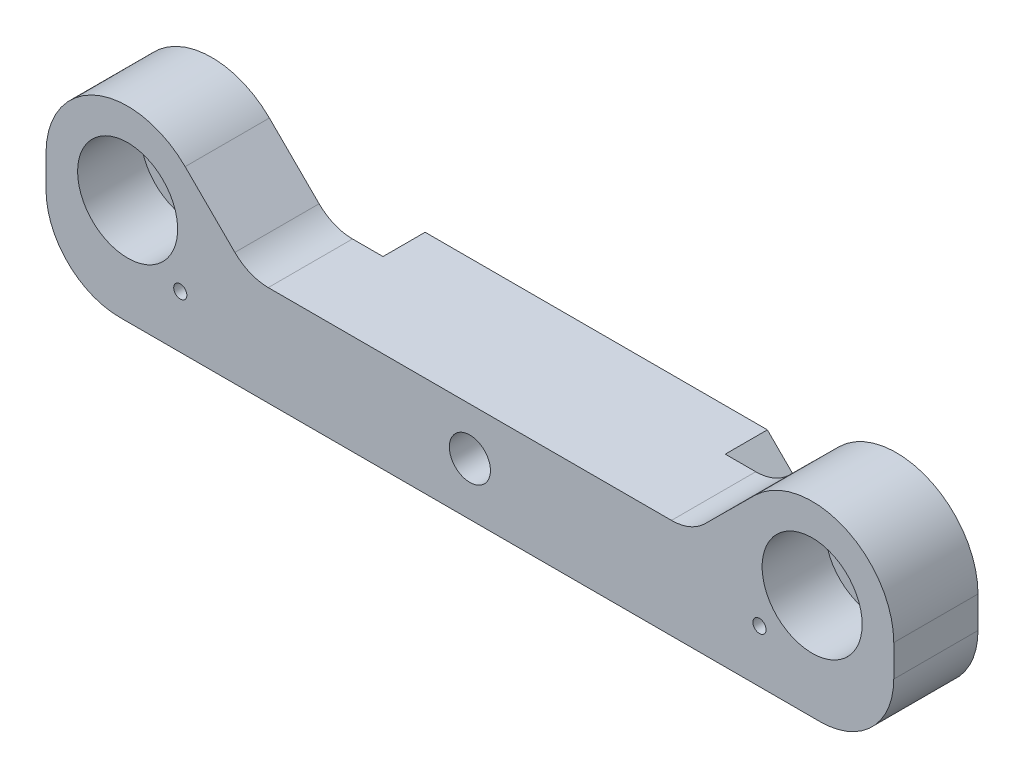
ISO-10303-21;
HEADER;
FILE_DESCRIPTION(('STEP AP214'),'2;1');
FILE_NAME('part.step','',(''),(''),'','','');
FILE_SCHEMA(('AUTOMOTIVE_DESIGN { 1 0 10303 214 1 1 1 1 }'));
ENDSEC;
DATA;
#1=APPLICATION_CONTEXT('core data for automotive mechanical design processes');
#2=APPLICATION_PROTOCOL_DEFINITION('international standard','automotive_design',2000,#1);
#3=PRODUCT_CONTEXT('',#1,'mechanical');
#4=PRODUCT('Part','Part','',(#3));
#5=PRODUCT_RELATED_PRODUCT_CATEGORY('part','',(#4));
#6=PRODUCT_DEFINITION_FORMATION('','',#4);
#7=PRODUCT_DEFINITION_CONTEXT('part definition',#1,'design');
#8=PRODUCT_DEFINITION('design','',#6,#7);
#9=PRODUCT_DEFINITION_SHAPE('','',#8);
#10=(LENGTH_UNIT() NAMED_UNIT(*) SI_UNIT(.MILLI.,.METRE.));
#11=(NAMED_UNIT(*) PLANE_ANGLE_UNIT() SI_UNIT($,.RADIAN.));
#12=(NAMED_UNIT(*) SI_UNIT($,.STERADIAN.) SOLID_ANGLE_UNIT());
#13=UNCERTAINTY_MEASURE_WITH_UNIT(LENGTH_MEASURE(1.E-05),#10,'distance_accuracy_value','');
#14=(GEOMETRIC_REPRESENTATION_CONTEXT(3) GLOBAL_UNCERTAINTY_ASSIGNED_CONTEXT((#13)) GLOBAL_UNIT_ASSIGNED_CONTEXT((#10,
#11,#12)) REPRESENTATION_CONTEXT('',''));
#15=CARTESIAN_POINT('',(0.,0.,0.));
#16=DIRECTION('',(0.,0.,1.));
#17=DIRECTION('',(1.,0.,0.));
#18=AXIS2_PLACEMENT_3D('',#15,#16,#17);
#19=CARTESIAN_POINT('',(-16.25,4.5,12.));
#20=DIRECTION('',(-0.707106781186544,0.707106781186551,0.));
#21=DIRECTION('',(-0.707106781186551,-0.707106781186544,0.));
#22=AXIS2_PLACEMENT_3D('',#19,#20,#21);
#23=PLANE('',#22);
#24=DIRECTION('',(-0.707106781186551,-0.707106781186544,0.));
#25=VECTOR('',#24,1.);
#26=CARTESIAN_POINT('',(-16.25,4.5,4.));
#27=LINE('',#26,#25);
#28=CARTESIAN_POINT('',(-16.25,4.5,4.));
#29=VERTEX_POINT('',#28);
#30=CARTESIAN_POINT('',(-18.75,1.99999999999998,4.));
#31=VERTEX_POINT('',#30);
#32=EDGE_CURVE('E372',#29,#31,#27,.T.);
#33=ORIENTED_EDGE('',*,*,#32,.F.);
#34=DIRECTION('',(0.,0.,1.));
#35=VECTOR('',#34,1.);
#36=CARTESIAN_POINT('',(-16.25,4.5,12.));
#37=LINE('',#36,#35);
#38=CARTESIAN_POINT('',(-16.25,4.5,0.));
#39=VERTEX_POINT('',#38);
#40=EDGE_CURVE('E367',#39,#29,#37,.T.);
#41=ORIENTED_EDGE('',*,*,#40,.F.);
#42=DIRECTION('',(0.707106781186551,0.707106781186544,0.));
#43=VECTOR('',#42,1.);
#44=CARTESIAN_POINT('',(2.87500000000018,23.6249999999999,0.));
#45=LINE('',#44,#43);
#46=CARTESIAN_POINT('',(-18.75,1.99999999999997,0.));
#47=VERTEX_POINT('',#46);
#48=EDGE_CURVE('E252',#47,#39,#45,.T.);
#49=ORIENTED_EDGE('',*,*,#48,.F.);
#50=DIRECTION('',(0.,0.,-1.));
#51=VECTOR('',#50,1.);
#52=CARTESIAN_POINT('',(-18.75,1.99999999999998,0.));
#53=LINE('',#52,#51);
#54=EDGE_CURVE('E379',#31,#47,#53,.T.);
#55=ORIENTED_EDGE('',*,*,#54,.F.);
#56=EDGE_LOOP('',(#33,#41,#49,#55));
#57=FACE_BOUND('',#56,.T.);
#58=ADVANCED_FACE('F39',(#57),#23,.T.);
#59=CARTESIAN_POINT('',(16.25,4.5,12.));
#60=DIRECTION('',(0.707106781186544,0.707106781186551,0.));
#61=DIRECTION('',(-0.707106781186551,0.707106781186544,0.));
#62=AXIS2_PLACEMENT_3D('',#59,#60,#61);
#63=PLANE('',#62);
#64=DIRECTION('',(0.,0.,-1.));
#65=VECTOR('',#64,1.);
#66=CARTESIAN_POINT('',(16.25,4.5,0.));
#67=LINE('',#66,#65);
#68=CARTESIAN_POINT('',(16.25,4.5,4.));
#69=VERTEX_POINT('',#68);
#70=CARTESIAN_POINT('',(16.25,4.5,0.));
#71=VERTEX_POINT('',#70);
#72=EDGE_CURVE('E282',#69,#71,#67,.T.);
#73=ORIENTED_EDGE('',*,*,#72,.F.);
#74=DIRECTION('',(-0.707106781186551,0.707106781186544,0.));
#75=VECTOR('',#74,1.);
#76=CARTESIAN_POINT('',(16.25,4.5,4.));
#77=LINE('',#76,#75);
#78=CARTESIAN_POINT('',(18.75,1.99999999999998,4.));
#79=VERTEX_POINT('',#78);
#80=EDGE_CURVE('E286',#79,#69,#77,.T.);
#81=ORIENTED_EDGE('',*,*,#80,.F.);
#82=DIRECTION('',(0.,0.,1.));
#83=VECTOR('',#82,1.);
#84=CARTESIAN_POINT('',(18.75,1.99999999999998,12.));
#85=LINE('',#84,#83);
#86=CARTESIAN_POINT('',(18.75,1.99999999999998,0.));
#87=VERTEX_POINT('',#86);
#88=EDGE_CURVE('E374',#87,#79,#85,.T.);
#89=ORIENTED_EDGE('',*,*,#88,.F.);
#90=DIRECTION('',(0.707106781186551,-0.707106781186544,0.));
#91=VECTOR('',#90,1.);
#92=CARTESIAN_POINT('',(12.125,8.62499999999995,0.));
#93=LINE('',#92,#91);
#94=EDGE_CURVE('E248',#71,#87,#93,.T.);
#95=ORIENTED_EDGE('',*,*,#94,.F.);
#96=EDGE_LOOP('',(#73,#81,#89,#95));
#97=FACE_BOUND('',#96,.T.);
#98=ADVANCED_FACE('F530',(#97),#63,.T.);
#99=CARTESIAN_POINT('',(15.,0.,12.));
#100=DIRECTION('',(0.,0.,1.));
#101=DIRECTION('',(1.,0.,0.));
#102=AXIS2_PLACEMENT_3D('',#99,#100,#101);
#103=CYLINDRICAL_SURFACE('',#102,0.999999999999997);
#104=CARTESIAN_POINT('',(15.,0.,0.));
#105=DIRECTION('',(0.,0.,-1.));
#106=DIRECTION('',(-1.,0.,0.));
#107=AXIS2_PLACEMENT_3D('',#104,#105,#106);
#108=CIRCLE('',#107,0.999999999999997);
#109=CARTESIAN_POINT('',(14.,0.,0.));
#110=VERTEX_POINT('',#109);
#111=EDGE_CURVE('E316',#110,#110,#108,.T.);
#112=ORIENTED_EDGE('',*,*,#111,.T.);
#113=EDGE_LOOP('',(#112));
#114=FACE_BOUND('',#113,.T.);
#115=CARTESIAN_POINT('',(15.,0.,10.));
#116=DIRECTION('',(0.,0.,1.));
#117=DIRECTION('',(1.,0.,0.));
#118=AXIS2_PLACEMENT_3D('',#115,#116,#117);
#119=CIRCLE('',#118,0.999999999999997);
#120=CARTESIAN_POINT('',(16.,0.,10.));
#121=VERTEX_POINT('',#120);
#122=EDGE_CURVE('E393',#121,#121,#119,.F.);
#123=ORIENTED_EDGE('',*,*,#122,.F.);
#124=EDGE_LOOP('',(#123));
#125=FACE_BOUND('',#124,.T.);
#126=ADVANCED_FACE('F535',(#114,#125),#103,.F.);
#127=CARTESIAN_POINT('',(-15.,0.,12.));
#128=DIRECTION('',(0.,0.,1.));
#129=DIRECTION('',(1.,0.,0.));
#130=AXIS2_PLACEMENT_3D('',#127,#128,#129);
#131=CYLINDRICAL_SURFACE('',#130,0.999999999999991);
#132=CARTESIAN_POINT('',(-15.,0.,0.));
#133=DIRECTION('',(0.,0.,-1.));
#134=DIRECTION('',(-1.,0.,0.));
#135=AXIS2_PLACEMENT_3D('',#132,#133,#134);
#136=CIRCLE('',#135,0.999999999999991);
#137=CARTESIAN_POINT('',(-16.,0.,0.));
#138=VERTEX_POINT('',#137);
#139=EDGE_CURVE('E320',#138,#138,#136,.T.);
#140=ORIENTED_EDGE('',*,*,#139,.T.);
#141=EDGE_LOOP('',(#140));
#142=FACE_BOUND('',#141,.T.);
#143=CARTESIAN_POINT('',(-15.,0.,10.));
#144=DIRECTION('',(0.,0.,1.));
#145=DIRECTION('',(1.,0.,0.));
#146=AXIS2_PLACEMENT_3D('',#143,#144,#145);
#147=CIRCLE('',#146,0.999999999999991);
#148=CARTESIAN_POINT('',(-14.,0.,10.));
#149=VERTEX_POINT('',#148);
#150=EDGE_CURVE('E391',#149,#149,#147,.F.);
#151=ORIENTED_EDGE('',*,*,#150,.F.);
#152=EDGE_LOOP('',(#151));
#153=FACE_BOUND('',#152,.T.);
#154=ADVANCED_FACE('F592',(#142,#153),#131,.F.);
#155=CARTESIAN_POINT('',(0.,0.,12.));
#156=DIRECTION('',(0.,0.,1.));
#157=DIRECTION('',(1.,0.,0.));
#158=AXIS2_PLACEMENT_3D('',#155,#156,#157);
#159=CYLINDRICAL_SURFACE('',#158,1.45);
#160=CARTESIAN_POINT('',(0.,0.,0.));
#161=DIRECTION('',(0.,0.,-1.));
#162=DIRECTION('',(-1.,0.,0.));
#163=AXIS2_PLACEMENT_3D('',#160,#161,#162);
#164=CIRCLE('',#163,1.45);
#165=CARTESIAN_POINT('',(-1.45,0.,0.));
#166=VERTEX_POINT('',#165);
#167=EDGE_CURVE('E236',#166,#166,#164,.T.);
#168=ORIENTED_EDGE('',*,*,#167,.T.);
#169=EDGE_LOOP('',(#168));
#170=FACE_BOUND('',#169,.T.);
#171=CARTESIAN_POINT('',(0.,0.,7.5));
#172=DIRECTION('',(0.,0.,1.));
#173=DIRECTION('',(1.,0.,0.));
#174=AXIS2_PLACEMENT_3D('',#171,#172,#173);
#175=CIRCLE('',#174,1.45);
#176=CARTESIAN_POINT('',(1.45,0.,7.5));
#177=VERTEX_POINT('',#176);
#178=EDGE_CURVE('E226',#177,#177,#175,.F.);
#179=ORIENTED_EDGE('',*,*,#178,.F.);
#180=EDGE_LOOP('',(#179));
#181=FACE_BOUND('',#180,.T.);
#182=ADVANCED_FACE('F589',(#170,#181),#159,.F.);
#183=CARTESIAN_POINT('',(-32.5,5.,22.));
#184=DIRECTION('',(0.,0.,-1.));
#185=DIRECTION('',(-1.,0.,0.));
#186=AXIS2_PLACEMENT_3D('',#183,#184,#185);
#187=CYLINDRICAL_SURFACE('',#186,3.1);
#188=CARTESIAN_POINT('',(-32.5,5.,6.));
#189=DIRECTION('',(0.,0.,1.));
#190=DIRECTION('',(1.,0.,0.));
#191=AXIS2_PLACEMENT_3D('',#188,#189,#190);
#192=CIRCLE('',#191,3.1);
#193=CARTESIAN_POINT('',(-29.4,5.,6.));
#194=VERTEX_POINT('',#193);
#195=EDGE_CURVE('E339',#194,#194,#192,.T.);
#196=ORIENTED_EDGE('',*,*,#195,.T.);
#197=EDGE_LOOP('',(#196));
#198=FACE_BOUND('',#197,.T.);
#199=CARTESIAN_POINT('',(-32.5,5.,4.));
#200=DIRECTION('',(0.,0.,-1.));
#201=DIRECTION('',(-1.,0.,0.));
#202=AXIS2_PLACEMENT_3D('',#199,#200,#201);
#203=CIRCLE('',#202,3.1);
#204=CARTESIAN_POINT('',(-35.6,5.,4.));
#205=VERTEX_POINT('',#204);
#206=EDGE_CURVE('E267',#205,#205,#203,.T.);
#207=ORIENTED_EDGE('',*,*,#206,.T.);
#208=EDGE_LOOP('',(#207));
#209=FACE_BOUND('',#208,.T.);
#210=ADVANCED_FACE('F525',(#198,#209),#187,.F.);
#211=CARTESIAN_POINT('',(32.5,5.,22.));
#212=DIRECTION('',(0.,0.,-1.));
#213=DIRECTION('',(-1.,0.,0.));
#214=AXIS2_PLACEMENT_3D('',#211,#212,#213);
#215=CYLINDRICAL_SURFACE('',#214,3.1);
#216=CARTESIAN_POINT('',(32.5,5.,6.));
#217=DIRECTION('',(0.,0.,1.));
#218=DIRECTION('',(1.,0.,0.));
#219=AXIS2_PLACEMENT_3D('',#216,#217,#218);
#220=CIRCLE('',#219,3.1);
#221=CARTESIAN_POINT('',(35.6,5.,6.));
#222=VERTEX_POINT('',#221);
#223=EDGE_CURVE('E321',#222,#222,#220,.T.);
#224=ORIENTED_EDGE('',*,*,#223,.T.);
#225=EDGE_LOOP('',(#224));
#226=FACE_BOUND('',#225,.T.);
#227=CARTESIAN_POINT('',(32.5,5.,4.));
#228=DIRECTION('',(0.,0.,-1.));
#229=DIRECTION('',(-1.,0.,0.));
#230=AXIS2_PLACEMENT_3D('',#227,#228,#229);
#231=CIRCLE('',#230,3.1);
#232=CARTESIAN_POINT('',(29.4,5.,4.));
#233=VERTEX_POINT('',#232);
#234=EDGE_CURVE('E299',#233,#233,#231,.T.);
#235=ORIENTED_EDGE('',*,*,#234,.T.);
#236=EDGE_LOOP('',(#235));
#237=FACE_BOUND('',#236,.T.);
#238=ADVANCED_FACE('F517',(#226,#237),#215,.F.);
#239=CARTESIAN_POINT('',(-39.25,3.49999999999999,12.));
#240=DIRECTION('',(0.,0.,1.));
#241=DIRECTION('',(1.,0.,0.));
#242=AXIS2_PLACEMENT_3D('',#239,#240,#241);
#243=PLANE('',#242);
#244=DIRECTION('',(0.,1.,0.));
#245=VECTOR('',#244,1.);
#246=CARTESIAN_POINT('',(-40.25,-5.,12.));
#247=LINE('',#246,#245);
#248=CARTESIAN_POINT('',(-40.25,2.,12.));
#249=VERTEX_POINT('',#248);
#250=CARTESIAN_POINT('',(-40.25,5.,12.));
#251=VERTEX_POINT('',#250);
#252=EDGE_CURVE('E205',#249,#251,#247,.T.);
#253=ORIENTED_EDGE('',*,*,#252,.F.);
#254=CARTESIAN_POINT('',(-33.25,2.,12.));
#255=DIRECTION('',(0.,0.,1.));
#256=DIRECTION('',(1.,0.,0.));
#257=AXIS2_PLACEMENT_3D('',#254,#255,#256);
#258=CIRCLE('',#257,7.);
#259=CARTESIAN_POINT('',(-33.25,-5.,12.));
#260=VERTEX_POINT('',#259);
#261=EDGE_CURVE('E427',#249,#260,#258,.T.);
#262=ORIENTED_EDGE('',*,*,#261,.T.);
#263=DIRECTION('',(-1.,0.,0.));
#264=VECTOR('',#263,1.);
#265=CARTESIAN_POINT('',(39.25,-5.,12.));
#266=LINE('',#265,#264);
#267=CARTESIAN_POINT('',(33.25,-5.,12.));
#268=VERTEX_POINT('',#267);
#269=EDGE_CURVE('E501',#268,#260,#266,.T.);
#270=ORIENTED_EDGE('',*,*,#269,.F.);
#271=CARTESIAN_POINT('',(33.25,2.,12.));
#272=DIRECTION('',(0.,0.,1.));
#273=DIRECTION('',(1.,0.,0.));
#274=AXIS2_PLACEMENT_3D('',#271,#272,#273);
#275=CIRCLE('',#274,7.);
#276=CARTESIAN_POINT('',(40.25,2.00000000000001,12.));
#277=VERTEX_POINT('',#276);
#278=EDGE_CURVE('E61',#268,#277,#275,.T.);
#279=ORIENTED_EDGE('',*,*,#278,.T.);
#280=DIRECTION('',(0.,-1.,0.));
#281=VECTOR('',#280,1.);
#282=CARTESIAN_POINT('',(40.25,-5.,12.));
#283=LINE('',#282,#281);
#284=CARTESIAN_POINT('',(40.25,5.,12.));
#285=VERTEX_POINT('',#284);
#286=EDGE_CURVE('E189',#285,#277,#283,.T.);
#287=ORIENTED_EDGE('',*,*,#286,.F.);
#288=CARTESIAN_POINT('',(32.5,5.,12.));
#289=DIRECTION('',(0.,0.,1.));
#290=DIRECTION('',(1.,0.,0.));
#291=AXIS2_PLACEMENT_3D('',#288,#289,#290);
#292=CIRCLE('',#291,7.75000000000001);
#293=CARTESIAN_POINT('',(27.0381210469589,10.4982159199441,12.));
#294=VERTEX_POINT('',#293);
#295=EDGE_CURVE('E178',#294,#285,#292,.F.);
#296=ORIENTED_EDGE('',*,*,#295,.F.);
#297=DIRECTION('',(0.709447215476664,0.704758574585941,0.));
#298=VECTOR('',#297,1.);
#299=CARTESIAN_POINT('',(27.038121046959,10.4982159199442,12.));
#300=LINE('',#299,#298);
#301=CARTESIAN_POINT('',(22.316186026152,5.80748753035501,12.));
#302=VERTEX_POINT('',#301);
#303=EDGE_CURVE('E441',#302,#294,#300,.T.);
#304=ORIENTED_EDGE('',*,*,#303,.F.);
#305=CARTESIAN_POINT('',(19.1447724405153,9.,12.));
#306=DIRECTION('',(0.,0.,1.));
#307=DIRECTION('',(1.,0.,0.));
#308=AXIS2_PLACEMENT_3D('',#305,#306,#307);
#309=CIRCLE('',#308,4.5);
#310=CARTESIAN_POINT('',(19.1447724405153,4.5,12.));
#311=VERTEX_POINT('',#310);
#312=EDGE_CURVE('E411',#302,#311,#309,.F.);
#313=ORIENTED_EDGE('',*,*,#312,.T.);
#314=DIRECTION('',(1.,0.,0.));
#315=VECTOR('',#314,1.);
#316=CARTESIAN_POINT('',(-18.75,4.5,12.));
#317=LINE('',#316,#315);
#318=CARTESIAN_POINT('',(-19.1447724405153,4.5,12.));
#319=VERTEX_POINT('',#318);
#320=EDGE_CURVE('E229',#319,#311,#317,.T.);
#321=ORIENTED_EDGE('',*,*,#320,.F.);
#322=CARTESIAN_POINT('',(-19.1447724405153,9.,12.));
#323=DIRECTION('',(0.,0.,1.));
#324=DIRECTION('',(1.,0.,0.));
#325=AXIS2_PLACEMENT_3D('',#322,#323,#324);
#326=CIRCLE('',#325,4.5);
#327=CARTESIAN_POINT('',(-22.316186026152,5.80748753035501,12.));
#328=VERTEX_POINT('',#327);
#329=EDGE_CURVE('E415',#319,#328,#326,.F.);
#330=ORIENTED_EDGE('',*,*,#329,.T.);
#331=DIRECTION('',(0.709447215476664,-0.704758574585941,0.));
#332=VECTOR('',#331,1.);
#333=CARTESIAN_POINT('',(-27.038121046959,10.4982159199442,12.));
#334=LINE('',#333,#332);
#335=CARTESIAN_POINT('',(-27.038121046959,10.4982159199442,12.));
#336=VERTEX_POINT('',#335);
#337=EDGE_CURVE('E447',#336,#328,#334,.T.);
#338=ORIENTED_EDGE('',*,*,#337,.F.);
#339=CARTESIAN_POINT('',(-32.5,5.,12.));
#340=DIRECTION('',(0.,0.,1.));
#341=DIRECTION('',(1.,0.,0.));
#342=AXIS2_PLACEMENT_3D('',#339,#340,#341);
#343=CIRCLE('',#342,7.75000000000001);
#344=EDGE_CURVE('E220',#251,#336,#343,.F.);
#345=ORIENTED_EDGE('',*,*,#344,.F.);
#346=EDGE_LOOP('',(#253,#262,#270,#279,#287,#296,#304,#313,#321,#330,#338,#345));
#347=FACE_BOUND('',#346,.T.);
#348=CARTESIAN_POINT('',(-27.5000005327804,0.00437002060559369,12.));
#349=DIRECTION('',(0.,0.,1.));
#350=DIRECTION('',(1.,0.,0.));
#351=AXIS2_PLACEMENT_3D('',#348,#349,#350);
#352=CIRCLE('',#351,0.624999999999997);
#353=CARTESIAN_POINT('',(-26.8750005327804,0.00437002060559369,12.));
#354=VERTEX_POINT('',#353);
#355=EDGE_CURVE('E484',#354,#354,#352,.T.);
#356=ORIENTED_EDGE('',*,*,#355,.F.);
#357=EDGE_LOOP('',(#356));
#358=FACE_BOUND('',#357,.T.);
#359=CARTESIAN_POINT('',(27.4999979927804,-0.0043700202019166,12.));
#360=DIRECTION('',(0.,0.,1.));
#361=DIRECTION('',(1.,0.,0.));
#362=AXIS2_PLACEMENT_3D('',#359,#360,#361);
#363=CIRCLE('',#362,0.624999999999997);
#364=CARTESIAN_POINT('',(28.1249979927804,-0.0043700202019166,12.));
#365=VERTEX_POINT('',#364);
#366=EDGE_CURVE('E478',#365,#365,#363,.T.);
#367=ORIENTED_EDGE('',*,*,#366,.F.);
#368=EDGE_LOOP('',(#367));
#369=FACE_BOUND('',#368,.T.);
#370=CARTESIAN_POINT('',(0.,0.,12.));
#371=DIRECTION('',(0.,0.,1.));
#372=DIRECTION('',(1.,0.,0.));
#373=AXIS2_PLACEMENT_3D('',#370,#371,#372);
#374=CIRCLE('',#373,1.95);
#375=CARTESIAN_POINT('',(1.95,0.,12.));
#376=VERTEX_POINT('',#375);
#377=EDGE_CURVE('E219',#376,#376,#374,.T.);
#378=ORIENTED_EDGE('',*,*,#377,.F.);
#379=EDGE_LOOP('',(#378));
#380=FACE_BOUND('',#379,.T.);
#381=CARTESIAN_POINT('',(-32.5,5.,12.));
#382=DIRECTION('',(0.,0.,-1.));
#383=DIRECTION('',(-1.,0.,0.));
#384=AXIS2_PLACEMENT_3D('',#381,#382,#383);
#385=CIRCLE('',#384,4.75);
#386=CARTESIAN_POINT('',(-37.25,5.,12.));
#387=VERTEX_POINT('',#386);
#388=EDGE_CURVE('E503',#387,#387,#385,.T.);
#389=ORIENTED_EDGE('',*,*,#388,.T.);
#390=EDGE_LOOP('',(#389));
#391=FACE_BOUND('',#390,.T.);
#392=CARTESIAN_POINT('',(32.5,5.,12.));
#393=DIRECTION('',(0.,0.,1.));
#394=DIRECTION('',(1.,0.,0.));
#395=AXIS2_PLACEMENT_3D('',#392,#393,#394);
#396=CIRCLE('',#395,4.75);
#397=CARTESIAN_POINT('',(37.25,5.,12.));
#398=VERTEX_POINT('',#397);
#399=EDGE_CURVE('E322',#398,#398,#396,.T.);
#400=ORIENTED_EDGE('',*,*,#399,.F.);
#401=EDGE_LOOP('',(#400));
#402=FACE_BOUND('',#401,.T.);
#403=ADVANCED_FACE('F191',(#347,#358,#369,#380,#391,#402),#243,.T.);
#404=CARTESIAN_POINT('',(-18.75,-3.50000000000001,-3.15));
#405=DIRECTION('',(1.,0.,0.));
#406=DIRECTION('',(0.,1.,0.));
#407=AXIS2_PLACEMENT_3D('',#404,#405,#406);
#408=PLANE('',#407);
#409=DIRECTION('',(0.,-1.,0.));
#410=VECTOR('',#409,1.);
#411=CARTESIAN_POINT('',(-18.75,-3.50000000000001,0.));
#412=LINE('',#411,#410);
#413=CARTESIAN_POINT('',(-18.75,-2.49999999999999,0.));
#414=VERTEX_POINT('',#413);
#415=EDGE_CURVE('E327',#47,#414,#412,.T.);
#416=ORIENTED_EDGE('',*,*,#415,.T.);
#417=DIRECTION('',(0.,0.,1.));
#418=VECTOR('',#417,1.);
#419=CARTESIAN_POINT('',(-18.75,-2.49999999999999,4.));
#420=LINE('',#419,#418);
#421=CARTESIAN_POINT('',(-18.75,-2.49999999999999,4.));
#422=VERTEX_POINT('',#421);
#423=EDGE_CURVE('E378',#414,#422,#420,.T.);
#424=ORIENTED_EDGE('',*,*,#423,.T.);
#425=DIRECTION('',(0.,-1.,0.));
#426=VECTOR('',#425,1.);
#427=CARTESIAN_POINT('',(-18.75,-5.,4.));
#428=LINE('',#427,#426);
#429=EDGE_CURVE('E264',#31,#422,#428,.T.);
#430=ORIENTED_EDGE('',*,*,#429,.F.);
#431=ORIENTED_EDGE('',*,*,#54,.T.);
#432=EDGE_LOOP('',(#416,#424,#430,#431));
#433=FACE_BOUND('',#432,.T.);
#434=ADVANCED_FACE('F384',(#433),#408,.F.);
#435=CARTESIAN_POINT('',(18.75,-3.50000000000001,-3.15));
#436=DIRECTION('',(-1.,0.,0.));
#437=DIRECTION('',(0.,-1.,0.));
#438=AXIS2_PLACEMENT_3D('',#435,#436,#437);
#439=PLANE('',#438);
#440=DIRECTION('',(0.,1.,0.));
#441=VECTOR('',#440,1.);
#442=CARTESIAN_POINT('',(18.75,-5.,4.));
#443=LINE('',#442,#441);
#444=CARTESIAN_POINT('',(18.75,-2.49999999999998,4.));
#445=VERTEX_POINT('',#444);
#446=EDGE_CURVE('E295',#445,#79,#443,.T.);
#447=ORIENTED_EDGE('',*,*,#446,.F.);
#448=DIRECTION('',(0.,0.,-1.));
#449=VECTOR('',#448,1.);
#450=CARTESIAN_POINT('',(18.75,-2.49999999999998,0.));
#451=LINE('',#450,#449);
#452=CARTESIAN_POINT('',(18.75,-2.49999999999998,0.));
#453=VERTEX_POINT('',#452);
#454=EDGE_CURVE('E373',#445,#453,#451,.T.);
#455=ORIENTED_EDGE('',*,*,#454,.T.);
#456=DIRECTION('',(0.,-1.,0.));
#457=VECTOR('',#456,1.);
#458=CARTESIAN_POINT('',(18.75,-3.50000000000001,0.));
#459=LINE('',#458,#457);
#460=EDGE_CURVE('E330',#87,#453,#459,.T.);
#461=ORIENTED_EDGE('',*,*,#460,.F.);
#462=ORIENTED_EDGE('',*,*,#88,.T.);
#463=EDGE_LOOP('',(#447,#455,#461,#462));
#464=FACE_BOUND('',#463,.T.);
#465=ADVANCED_FACE('F523',(#464),#439,.F.);
#466=CARTESIAN_POINT('',(15.,11.5,0.));
#467=DIRECTION('',(0.,0.,-1.));
#468=DIRECTION('',(-1.,0.,0.));
#469=AXIS2_PLACEMENT_3D('',#466,#467,#468);
#470=PLANE('',#469);
#471=ORIENTED_EDGE('',*,*,#167,.F.);
#472=EDGE_LOOP('',(#471));
#473=FACE_BOUND('',#472,.T.);
#474=ORIENTED_EDGE('',*,*,#111,.F.);
#475=EDGE_LOOP('',(#474));
#476=FACE_BOUND('',#475,.T.);
#477=ORIENTED_EDGE('',*,*,#139,.F.);
#478=EDGE_LOOP('',(#477));
#479=FACE_BOUND('',#478,.T.);
#480=DIRECTION('',(1.,0.,0.));
#481=VECTOR('',#480,1.);
#482=CARTESIAN_POINT('',(-18.75,-5.,0.));
#483=LINE('',#482,#481);
#484=CARTESIAN_POINT('',(-16.25,-5.,0.));
#485=VERTEX_POINT('',#484);
#486=CARTESIAN_POINT('',(16.25,-5.,0.));
#487=VERTEX_POINT('',#486);
#488=EDGE_CURVE('E303',#485,#487,#483,.T.);
#489=ORIENTED_EDGE('',*,*,#488,.F.);
#490=DIRECTION('',(-0.707106781186547,0.707106781186548,0.));
#491=VECTOR('',#490,1.);
#492=CARTESIAN_POINT('',(-8.87500000000001,-12.375,0.));
#493=LINE('',#492,#491);
#494=EDGE_CURVE('E257',#485,#414,#493,.T.);
#495=ORIENTED_EDGE('',*,*,#494,.T.);
#496=ORIENTED_EDGE('',*,*,#415,.F.);
#497=ORIENTED_EDGE('',*,*,#48,.T.);
#498=DIRECTION('',(-1.,0.,0.));
#499=VECTOR('',#498,1.);
#500=CARTESIAN_POINT('',(-18.75,4.5,0.));
#501=LINE('',#500,#499);
#502=EDGE_CURVE('E232',#71,#39,#501,.T.);
#503=ORIENTED_EDGE('',*,*,#502,.F.);
#504=ORIENTED_EDGE('',*,*,#94,.T.);
#505=ORIENTED_EDGE('',*,*,#460,.T.);
#506=DIRECTION('',(-0.707106781186546,-0.707106781186549,0.));
#507=VECTOR('',#506,1.);
#508=CARTESIAN_POINT('',(23.875,2.62500000000004,0.));
#509=LINE('',#508,#507);
#510=EDGE_CURVE('E251',#453,#487,#509,.T.);
#511=ORIENTED_EDGE('',*,*,#510,.T.);
#512=EDGE_LOOP('',(#489,#495,#496,#497,#503,#504,#505,#511));
#513=FACE_BOUND('',#512,.T.);
#514=ADVANCED_FACE('F359',(#473,#476,#479,#513),#470,.T.);
#515=CARTESIAN_POINT('',(32.5,5.,6.));
#516=DIRECTION('',(0.,0.,1.));
#517=DIRECTION('',(1.,0.,0.));
#518=AXIS2_PLACEMENT_3D('',#515,#516,#517);
#519=CYLINDRICAL_SURFACE('',#518,4.75);
#520=CARTESIAN_POINT('',(32.5,5.,6.));
#521=DIRECTION('',(0.,0.,1.));
#522=DIRECTION('',(1.,0.,0.));
#523=AXIS2_PLACEMENT_3D('',#520,#521,#522);
#524=CIRCLE('',#523,4.75);
#525=CARTESIAN_POINT('',(37.25,5.,6.));
#526=VERTEX_POINT('',#525);
#527=EDGE_CURVE('E338',#526,#526,#524,.T.);
#528=ORIENTED_EDGE('',*,*,#527,.F.);
#529=EDGE_LOOP('',(#528));
#530=FACE_BOUND('',#529,.T.);
#531=ORIENTED_EDGE('',*,*,#399,.T.);
#532=EDGE_LOOP('',(#531));
#533=FACE_BOUND('',#532,.T.);
#534=ADVANCED_FACE('F514',(#530,#533),#519,.F.);
#535=CARTESIAN_POINT('',(32.5,5.,6.));
#536=DIRECTION('',(0.,0.,1.));
#537=DIRECTION('',(1.,0.,0.));
#538=AXIS2_PLACEMENT_3D('',#535,#536,#537);
#539=PLANE('',#538);
#540=ORIENTED_EDGE('',*,*,#223,.F.);
#541=EDGE_LOOP('',(#540));
#542=FACE_BOUND('',#541,.T.);
#543=ORIENTED_EDGE('',*,*,#527,.T.);
#544=EDGE_LOOP('',(#543));
#545=FACE_BOUND('',#544,.T.);
#546=ADVANCED_FACE('F607',(#542,#545),#539,.T.);
#547=CARTESIAN_POINT('',(-32.5,5.,6.));
#548=DIRECTION('',(0.,0.,1.));
#549=DIRECTION('',(1.,0.,0.));
#550=AXIS2_PLACEMENT_3D('',#547,#548,#549);
#551=CYLINDRICAL_SURFACE('',#550,4.75);
#552=CARTESIAN_POINT('',(-32.5,5.,6.));
#553=DIRECTION('',(0.,0.,-1.));
#554=DIRECTION('',(-1.,0.,0.));
#555=AXIS2_PLACEMENT_3D('',#552,#553,#554);
#556=CIRCLE('',#555,4.75);
#557=CARTESIAN_POINT('',(-37.25,5.,6.));
#558=VERTEX_POINT('',#557);
#559=EDGE_CURVE('E341',#558,#558,#556,.T.);
#560=ORIENTED_EDGE('',*,*,#559,.T.);
#561=EDGE_LOOP('',(#560));
#562=FACE_BOUND('',#561,.T.);
#563=ORIENTED_EDGE('',*,*,#388,.F.);
#564=EDGE_LOOP('',(#563));
#565=FACE_BOUND('',#564,.T.);
#566=ADVANCED_FACE('F603',(#562,#565),#551,.F.);
#567=CARTESIAN_POINT('',(-32.5,5.,6.));
#568=DIRECTION('',(0.,0.,1.));
#569=DIRECTION('',(-1.,0.,0.));
#570=AXIS2_PLACEMENT_3D('',#567,#568,#569);
#571=PLANE('',#570);
#572=ORIENTED_EDGE('',*,*,#195,.F.);
#573=EDGE_LOOP('',(#572));
#574=FACE_BOUND('',#573,.T.);
#575=ORIENTED_EDGE('',*,*,#559,.F.);
#576=EDGE_LOOP('',(#575));
#577=FACE_BOUND('',#576,.T.);
#578=ADVANCED_FACE('F600',(#574,#577),#571,.T.);
#579=CARTESIAN_POINT('',(-18.75,-5.,0.));
#580=DIRECTION('',(0.,-1.,0.));
#581=DIRECTION('',(1.,0.,0.));
#582=AXIS2_PLACEMENT_3D('',#579,#580,#581);
#583=PLANE('',#582);
#584=ORIENTED_EDGE('',*,*,#269,.T.);
#585=DIRECTION('',(0.,0.,-1.));
#586=VECTOR('',#585,1.);
#587=CARTESIAN_POINT('',(-33.25,-5.,0.));
#588=LINE('',#587,#586);
#589=CARTESIAN_POINT('',(-33.25,-5.,4.));
#590=VERTEX_POINT('',#589);
#591=EDGE_CURVE('E419',#260,#590,#588,.T.);
#592=ORIENTED_EDGE('',*,*,#591,.T.);
#593=DIRECTION('',(-1.,0.,0.));
#594=VECTOR('',#593,1.);
#595=CARTESIAN_POINT('',(-18.75,-5.,4.));
#596=LINE('',#595,#594);
#597=CARTESIAN_POINT('',(-16.25,-5.,4.));
#598=VERTEX_POINT('',#597);
#599=EDGE_CURVE('E260',#598,#590,#596,.T.);
#600=ORIENTED_EDGE('',*,*,#599,.F.);
#601=DIRECTION('',(0.,0.,-1.));
#602=VECTOR('',#601,1.);
#603=CARTESIAN_POINT('',(-16.25,-5.,0.));
#604=LINE('',#603,#602);
#605=EDGE_CURVE('E349',#598,#485,#604,.T.);
#606=ORIENTED_EDGE('',*,*,#605,.T.);
#607=ORIENTED_EDGE('',*,*,#488,.T.);
#608=DIRECTION('',(0.,0.,1.));
#609=VECTOR('',#608,1.);
#610=CARTESIAN_POINT('',(16.25,-5.,4.));
#611=LINE('',#610,#609);
#612=CARTESIAN_POINT('',(16.25,-5.,4.));
#613=VERTEX_POINT('',#612);
#614=EDGE_CURVE('E345',#487,#613,#611,.T.);
#615=ORIENTED_EDGE('',*,*,#614,.T.);
#616=DIRECTION('',(1.,0.,0.));
#617=VECTOR('',#616,1.);
#618=CARTESIAN_POINT('',(-18.75,-5.,4.));
#619=LINE('',#618,#617);
#620=CARTESIAN_POINT('',(33.25,-5.,4.));
#621=VERTEX_POINT('',#620);
#622=EDGE_CURVE('E335',#613,#621,#619,.T.);
#623=ORIENTED_EDGE('',*,*,#622,.T.);
#624=DIRECTION('',(0.,0.,-1.));
#625=VECTOR('',#624,1.);
#626=CARTESIAN_POINT('',(33.25,-5.,0.));
#627=LINE('',#626,#625);
#628=EDGE_CURVE('E417',#621,#268,#627,.F.);
#629=ORIENTED_EDGE('',*,*,#628,.T.);
#630=EDGE_LOOP('',(#584,#592,#600,#606,#607,#615,#623,#629));
#631=FACE_BOUND('',#630,.T.);
#632=ADVANCED_FACE('F502',(#631),#583,.T.);
#633=CARTESIAN_POINT('',(18.75,15.0715164433417,4.));
#634=DIRECTION('',(0.,0.,-1.));
#635=DIRECTION('',(-1.,0.,0.));
#636=AXIS2_PLACEMENT_3D('',#633,#634,#635);
#637=PLANE('',#636);
#638=DIRECTION('',(0.,-1.,0.));
#639=VECTOR('',#638,1.);
#640=CARTESIAN_POINT('',(40.25,-5.,4.));
#641=LINE('',#640,#639);
#642=CARTESIAN_POINT('',(40.25,5.,4.));
#643=VERTEX_POINT('',#642);
#644=CARTESIAN_POINT('',(40.25,2.00000000000001,4.));
#645=VERTEX_POINT('',#644);
#646=EDGE_CURVE('E199',#643,#645,#641,.T.);
#647=ORIENTED_EDGE('',*,*,#646,.T.);
#648=CARTESIAN_POINT('',(33.25,2.,4.));
#649=DIRECTION('',(0.,0.,-1.));
#650=DIRECTION('',(-1.,0.,0.));
#651=AXIS2_PLACEMENT_3D('',#648,#649,#650);
#652=CIRCLE('',#651,7.);
#653=EDGE_CURVE('E12',#645,#621,#652,.T.);
#654=ORIENTED_EDGE('',*,*,#653,.T.);
#655=ORIENTED_EDGE('',*,*,#622,.F.);
#656=DIRECTION('',(0.707106781186546,0.707106781186549,0.));
#657=VECTOR('',#656,1.);
#658=CARTESIAN_POINT('',(16.25,-5.,4.));
#659=LINE('',#658,#657);
#660=EDGE_CURVE('E281',#613,#445,#659,.T.);
#661=ORIENTED_EDGE('',*,*,#660,.T.);
#662=ORIENTED_EDGE('',*,*,#446,.T.);
#663=ORIENTED_EDGE('',*,*,#80,.T.);
#664=DIRECTION('',(1.,0.,0.));
#665=VECTOR('',#664,1.);
#666=CARTESIAN_POINT('',(21.,4.5,4.));
#667=LINE('',#666,#665);
#668=CARTESIAN_POINT('',(19.1447724405153,4.5,4.));
#669=VERTEX_POINT('',#668);
#670=EDGE_CURVE('E442',#69,#669,#667,.T.);
#671=ORIENTED_EDGE('',*,*,#670,.T.);
#672=CARTESIAN_POINT('',(19.1447724405153,9.,4.));
#673=DIRECTION('',(0.,0.,-1.));
#674=DIRECTION('',(-1.,0.,0.));
#675=AXIS2_PLACEMENT_3D('',#672,#673,#674);
#676=CIRCLE('',#675,4.5);
#677=CARTESIAN_POINT('',(22.316186026152,5.80748753035501,4.));
#678=VERTEX_POINT('',#677);
#679=EDGE_CURVE('E409',#669,#678,#676,.F.);
#680=ORIENTED_EDGE('',*,*,#679,.T.);
#681=DIRECTION('',(0.709447215476664,0.704758574585941,0.));
#682=VECTOR('',#681,1.);
#683=CARTESIAN_POINT('',(27.038121046959,10.4982159199442,4.));
#684=LINE('',#683,#682);
#685=CARTESIAN_POINT('',(27.038121046959,10.4982159199442,4.));
#686=VERTEX_POINT('',#685);
#687=EDGE_CURVE('E432',#678,#686,#684,.T.);
#688=ORIENTED_EDGE('',*,*,#687,.T.);
#689=CARTESIAN_POINT('',(32.5,5.,4.));
#690=DIRECTION('',(0.,0.,-1.));
#691=DIRECTION('',(1.,0.,0.));
#692=AXIS2_PLACEMENT_3D('',#689,#690,#691);
#693=CIRCLE('',#692,7.75000000000001);
#694=EDGE_CURVE('E187',#686,#643,#693,.T.);
#695=ORIENTED_EDGE('',*,*,#694,.T.);
#696=EDGE_LOOP('',(#647,#654,#655,#661,#662,#663,#671,#680,#688,#695));
#697=FACE_BOUND('',#696,.T.);
#698=CARTESIAN_POINT('',(27.4999979927804,-0.0043700202019166,4.));
#699=DIRECTION('',(0.,0.,-1.));
#700=DIRECTION('',(-1.,0.,0.));
#701=AXIS2_PLACEMENT_3D('',#698,#699,#700);
#702=CIRCLE('',#701,0.624999999999995);
#703=CARTESIAN_POINT('',(26.8749979927804,-0.0043700202019166,4.));
#704=VERTEX_POINT('',#703);
#705=EDGE_CURVE('E473',#704,#704,#702,.T.);
#706=ORIENTED_EDGE('',*,*,#705,.F.);
#707=EDGE_LOOP('',(#706));
#708=FACE_BOUND('',#707,.T.);
#709=ORIENTED_EDGE('',*,*,#234,.F.);
#710=EDGE_LOOP('',(#709));
#711=FACE_BOUND('',#710,.T.);
#712=ADVANCED_FACE('F429',(#697,#708,#711),#637,.T.);
#713=CARTESIAN_POINT('',(-41.2333803667221,-5.,4.));
#714=DIRECTION('',(0.,0.,-1.));
#715=DIRECTION('',(-1.,0.,0.));
#716=AXIS2_PLACEMENT_3D('',#713,#714,#715);
#717=PLANE('',#716);
#718=ORIENTED_EDGE('',*,*,#599,.T.);
#719=CARTESIAN_POINT('',(-33.25,2.,4.));
#720=DIRECTION('',(0.,0.,-1.));
#721=DIRECTION('',(-1.,0.,0.));
#722=AXIS2_PLACEMENT_3D('',#719,#720,#721);
#723=CIRCLE('',#722,7.);
#724=CARTESIAN_POINT('',(-40.25,2.,4.));
#725=VERTEX_POINT('',#724);
#726=EDGE_CURVE('E421',#590,#725,#723,.T.);
#727=ORIENTED_EDGE('',*,*,#726,.T.);
#728=DIRECTION('',(0.,1.,0.));
#729=VECTOR('',#728,1.);
#730=CARTESIAN_POINT('',(-40.25,-5.,4.));
#731=LINE('',#730,#729);
#732=CARTESIAN_POINT('',(-40.25,5.,4.));
#733=VERTEX_POINT('',#732);
#734=EDGE_CURVE('E194',#725,#733,#731,.T.);
#735=ORIENTED_EDGE('',*,*,#734,.T.);
#736=CARTESIAN_POINT('',(-32.5,5.,4.));
#737=DIRECTION('',(0.,0.,-1.));
#738=DIRECTION('',(-1.,0.,0.));
#739=AXIS2_PLACEMENT_3D('',#736,#737,#738);
#740=CIRCLE('',#739,7.75000000000001);
#741=CARTESIAN_POINT('',(-27.038121046959,10.4982159199442,4.));
#742=VERTEX_POINT('',#741);
#743=EDGE_CURVE('E216',#733,#742,#740,.T.);
#744=ORIENTED_EDGE('',*,*,#743,.T.);
#745=DIRECTION('',(0.709447215476664,-0.704758574585941,0.));
#746=VECTOR('',#745,1.);
#747=CARTESIAN_POINT('',(-27.038121046959,10.4982159199442,4.));
#748=LINE('',#747,#746);
#749=CARTESIAN_POINT('',(-22.316186026152,5.80748753035501,4.));
#750=VERTEX_POINT('',#749);
#751=EDGE_CURVE('E470',#742,#750,#748,.T.);
#752=ORIENTED_EDGE('',*,*,#751,.T.);
#753=CARTESIAN_POINT('',(-19.1447724405153,9.,4.));
#754=DIRECTION('',(0.,0.,-1.));
#755=DIRECTION('',(-1.,0.,0.));
#756=AXIS2_PLACEMENT_3D('',#753,#754,#755);
#757=CIRCLE('',#756,4.5);
#758=CARTESIAN_POINT('',(-19.1447724405153,4.5,4.));
#759=VERTEX_POINT('',#758);
#760=EDGE_CURVE('E413',#750,#759,#757,.F.);
#761=ORIENTED_EDGE('',*,*,#760,.T.);
#762=DIRECTION('',(1.,0.,0.));
#763=VECTOR('',#762,1.);
#764=CARTESIAN_POINT('',(-21.,4.5,4.));
#765=LINE('',#764,#763);
#766=EDGE_CURVE('E390',#759,#29,#765,.T.);
#767=ORIENTED_EDGE('',*,*,#766,.T.);
#768=ORIENTED_EDGE('',*,*,#32,.T.);
#769=ORIENTED_EDGE('',*,*,#429,.T.);
#770=DIRECTION('',(0.707106781186547,-0.707106781186548,0.));
#771=VECTOR('',#770,1.);
#772=CARTESIAN_POINT('',(-16.25,-5.,4.));
#773=LINE('',#772,#771);
#774=EDGE_CURVE('E276',#422,#598,#773,.T.);
#775=ORIENTED_EDGE('',*,*,#774,.T.);
#776=EDGE_LOOP('',(#718,#727,#735,#744,#752,#761,#767,#768,#769,#775));
#777=FACE_BOUND('',#776,.T.);
#778=CARTESIAN_POINT('',(-27.5000005327804,0.00437002060559369,4.));
#779=DIRECTION('',(0.,0.,-1.));
#780=DIRECTION('',(-1.,0.,0.));
#781=AXIS2_PLACEMENT_3D('',#778,#779,#780);
#782=CIRCLE('',#781,0.624999999999995);
#783=CARTESIAN_POINT('',(-28.1250005327804,0.00437002060559369,4.));
#784=VERTEX_POINT('',#783);
#785=EDGE_CURVE('E480',#784,#784,#782,.T.);
#786=ORIENTED_EDGE('',*,*,#785,.F.);
#787=EDGE_LOOP('',(#786));
#788=FACE_BOUND('',#787,.T.);
#789=ORIENTED_EDGE('',*,*,#206,.F.);
#790=EDGE_LOOP('',(#789));
#791=FACE_BOUND('',#790,.T.);
#792=ADVANCED_FACE('F388',(#777,#788,#791),#717,.T.);
#793=CARTESIAN_POINT('',(-18.75,4.5,12.));
#794=DIRECTION('',(0.,1.,0.));
#795=DIRECTION('',(-1.,0.,0.));
#796=AXIS2_PLACEMENT_3D('',#793,#794,#795);
#797=PLANE('',#796);
#798=ORIENTED_EDGE('',*,*,#320,.T.);
#799=DIRECTION('',(0.,0.,-1.));
#800=VECTOR('',#799,1.);
#801=CARTESIAN_POINT('',(19.1447724405153,4.5,4.));
#802=LINE('',#801,#800);
#803=EDGE_CURVE('E401',#311,#669,#802,.T.);
#804=ORIENTED_EDGE('',*,*,#803,.T.);
#805=ORIENTED_EDGE('',*,*,#670,.F.);
#806=ORIENTED_EDGE('',*,*,#72,.T.);
#807=ORIENTED_EDGE('',*,*,#502,.T.);
#808=ORIENTED_EDGE('',*,*,#40,.T.);
#809=ORIENTED_EDGE('',*,*,#766,.F.);
#810=DIRECTION('',(0.,0.,-1.));
#811=VECTOR('',#810,1.);
#812=CARTESIAN_POINT('',(-19.1447724405153,4.5,12.));
#813=LINE('',#812,#811);
#814=EDGE_CURVE('E399',#759,#319,#813,.F.);
#815=ORIENTED_EDGE('',*,*,#814,.T.);
#816=EDGE_LOOP('',(#798,#804,#805,#806,#807,#808,#809,#815));
#817=FACE_BOUND('',#816,.T.);
#818=ADVANCED_FACE('F365',(#817),#797,.T.);
#819=CARTESIAN_POINT('',(0.,0.,7.5));
#820=DIRECTION('',(0.,0.,1.));
#821=DIRECTION('',(1.,0.,0.));
#822=AXIS2_PLACEMENT_3D('',#819,#820,#821);
#823=PLANE('',#822);
#824=CARTESIAN_POINT('',(0.,0.,7.5));
#825=DIRECTION('',(0.,0.,1.));
#826=DIRECTION('',(1.,0.,0.));
#827=AXIS2_PLACEMENT_3D('',#824,#825,#826);
#828=CIRCLE('',#827,1.95);
#829=CARTESIAN_POINT('',(1.95,0.,7.5));
#830=VERTEX_POINT('',#829);
#831=EDGE_CURVE('E223',#830,#830,#828,.T.);
#832=ORIENTED_EDGE('',*,*,#831,.T.);
#833=EDGE_LOOP('',(#832));
#834=FACE_BOUND('',#833,.T.);
#835=ORIENTED_EDGE('',*,*,#178,.T.);
#836=EDGE_LOOP('',(#835));
#837=FACE_BOUND('',#836,.T.);
#838=ADVANCED_FACE('F579',(#834,#837),#823,.T.);
#839=CARTESIAN_POINT('',(0.,0.,7.5));
#840=DIRECTION('',(0.,0.,1.));
#841=DIRECTION('',(1.,0.,0.));
#842=AXIS2_PLACEMENT_3D('',#839,#840,#841);
#843=CYLINDRICAL_SURFACE('',#842,1.95);
#844=ORIENTED_EDGE('',*,*,#831,.F.);
#845=EDGE_LOOP('',(#844));
#846=FACE_BOUND('',#845,.T.);
#847=ORIENTED_EDGE('',*,*,#377,.T.);
#848=EDGE_LOOP('',(#847));
#849=FACE_BOUND('',#848,.T.);
#850=ADVANCED_FACE('F582',(#846,#849),#843,.F.);
#851=CARTESIAN_POINT('',(-16.25,-5.,0.));
#852=DIRECTION('',(-0.707106781186548,-0.707106781186547,0.));
#853=DIRECTION('',(0.707106781186547,-0.707106781186548,0.));
#854=AXIS2_PLACEMENT_3D('',#851,#852,#853);
#855=PLANE('',#854);
#856=ORIENTED_EDGE('',*,*,#774,.F.);
#857=ORIENTED_EDGE('',*,*,#423,.F.);
#858=ORIENTED_EDGE('',*,*,#494,.F.);
#859=ORIENTED_EDGE('',*,*,#605,.F.);
#860=EDGE_LOOP('',(#856,#857,#858,#859));
#861=FACE_BOUND('',#860,.T.);
#862=ADVANCED_FACE('F386',(#861),#855,.T.);
#863=CARTESIAN_POINT('',(16.25,-5.,0.));
#864=DIRECTION('',(0.707106781186549,-0.707106781186546,0.));
#865=DIRECTION('',(0.707106781186546,0.707106781186549,0.));
#866=AXIS2_PLACEMENT_3D('',#863,#864,#865);
#867=PLANE('',#866);
#868=ORIENTED_EDGE('',*,*,#510,.F.);
#869=ORIENTED_EDGE('',*,*,#454,.F.);
#870=ORIENTED_EDGE('',*,*,#660,.F.);
#871=ORIENTED_EDGE('',*,*,#614,.F.);
#872=EDGE_LOOP('',(#868,#869,#870,#871));
#873=FACE_BOUND('',#872,.T.);
#874=ADVANCED_FACE('F578',(#873),#867,.T.);
#875=CARTESIAN_POINT('',(-32.5,5.,33.920310216783));
#876=DIRECTION('',(0.,0.,-1.));
#877=DIRECTION('',(-1.,0.,0.));
#878=AXIS2_PLACEMENT_3D('',#875,#876,#877);
#879=CYLINDRICAL_SURFACE('',#878,7.75000000000001);
#880=DIRECTION('',(0.,0.,-1.));
#881=VECTOR('',#880,1.);
#882=CARTESIAN_POINT('',(-40.25,5.,22.0498756211209));
#883=LINE('',#882,#881);
#884=EDGE_CURVE('E486',#251,#733,#883,.T.);
#885=ORIENTED_EDGE('',*,*,#884,.F.);
#886=ORIENTED_EDGE('',*,*,#344,.T.);
#887=DIRECTION('',(0.,0.,-1.));
#888=VECTOR('',#887,1.);
#889=CARTESIAN_POINT('',(-27.038121046959,10.4982159199442,28.8919262615407));
#890=LINE('',#889,#888);
#891=EDGE_CURVE('E443',#336,#742,#890,.T.);
#892=ORIENTED_EDGE('',*,*,#891,.T.);
#893=ORIENTED_EDGE('',*,*,#743,.F.);
#894=EDGE_LOOP('',(#885,#886,#892,#893));
#895=FACE_BOUND('',#894,.T.);
#896=ADVANCED_FACE('F496',(#895),#879,.T.);
#897=CARTESIAN_POINT('',(32.5,5.,33.920310216783));
#898=DIRECTION('',(0.,0.,-1.));
#899=DIRECTION('',(-1.,0.,0.));
#900=AXIS2_PLACEMENT_3D('',#897,#898,#899);
#901=CYLINDRICAL_SURFACE('',#900,7.75000000000001);
#902=DIRECTION('',(0.,0.,-1.));
#903=VECTOR('',#902,1.);
#904=CARTESIAN_POINT('',(40.25,5.,22.0498756211209));
#905=LINE('',#904,#903);
#906=EDGE_CURVE('E182',#285,#643,#905,.T.);
#907=ORIENTED_EDGE('',*,*,#906,.T.);
#908=ORIENTED_EDGE('',*,*,#694,.F.);
#909=DIRECTION('',(0.,0.,-1.));
#910=VECTOR('',#909,1.);
#911=CARTESIAN_POINT('',(27.038121046959,10.4982159199442,28.8919262615407));
#912=LINE('',#911,#910);
#913=EDGE_CURVE('E185',#294,#686,#912,.T.);
#914=ORIENTED_EDGE('',*,*,#913,.F.);
#915=ORIENTED_EDGE('',*,*,#295,.T.);
#916=EDGE_LOOP('',(#907,#908,#914,#915));
#917=FACE_BOUND('',#916,.T.);
#918=ADVANCED_FACE('F179',(#917),#901,.T.);
#919=CARTESIAN_POINT('',(-15.,0.,10.));
#920=DIRECTION('',(0.,0.,1.));
#921=DIRECTION('',(1.,0.,0.));
#922=AXIS2_PLACEMENT_3D('',#919,#920,#921);
#923=PLANE('',#922);
#924=ORIENTED_EDGE('',*,*,#150,.T.);
#925=EDGE_LOOP('',(#924));
#926=FACE_BOUND('',#925,.T.);
#927=ADVANCED_FACE('F569',(#926),#923,.F.);
#928=CARTESIAN_POINT('',(15.,0.,10.));
#929=DIRECTION('',(0.,0.,1.));
#930=DIRECTION('',(1.,0.,0.));
#931=AXIS2_PLACEMENT_3D('',#928,#929,#930);
#932=PLANE('',#931);
#933=ORIENTED_EDGE('',*,*,#122,.T.);
#934=EDGE_LOOP('',(#933));
#935=FACE_BOUND('',#934,.T.);
#936=ADVANCED_FACE('F566',(#935),#932,.F.);
#937=CARTESIAN_POINT('',(27.038121046959,10.4982159199442,28.8919262615407));
#938=DIRECTION('',(-0.704758574585941,0.709447215476664,0.));
#939=DIRECTION('',(-0.709447215476664,-0.704758574585941,0.));
#940=AXIS2_PLACEMENT_3D('',#937,#938,#939);
#941=PLANE('',#940);
#942=ORIENTED_EDGE('',*,*,#687,.F.);
#943=DIRECTION('',(0.,0.,-1.));
#944=VECTOR('',#943,1.);
#945=CARTESIAN_POINT('',(22.316186026152,5.80748753035501,12.));
#946=LINE('',#945,#944);
#947=EDGE_CURVE('E404',#678,#302,#946,.F.);
#948=ORIENTED_EDGE('',*,*,#947,.T.);
#949=ORIENTED_EDGE('',*,*,#303,.T.);
#950=ORIENTED_EDGE('',*,*,#913,.T.);
#951=EDGE_LOOP('',(#942,#948,#949,#950));
#952=FACE_BOUND('',#951,.T.);
#953=ADVANCED_FACE('F449',(#952),#941,.T.);
#954=CARTESIAN_POINT('',(-27.038121046959,10.4982159199442,28.8919262615407));
#955=DIRECTION('',(0.704758574585941,0.709447215476664,0.));
#956=DIRECTION('',(-0.709447215476664,0.704758574585941,0.));
#957=AXIS2_PLACEMENT_3D('',#954,#955,#956);
#958=PLANE('',#957);
#959=ORIENTED_EDGE('',*,*,#337,.T.);
#960=DIRECTION('',(0.,0.,-1.));
#961=VECTOR('',#960,1.);
#962=CARTESIAN_POINT('',(-22.316186026152,5.80748753035501,4.));
#963=LINE('',#962,#961);
#964=EDGE_CURVE('E406',#328,#750,#963,.T.);
#965=ORIENTED_EDGE('',*,*,#964,.T.);
#966=ORIENTED_EDGE('',*,*,#751,.F.);
#967=ORIENTED_EDGE('',*,*,#891,.F.);
#968=EDGE_LOOP('',(#959,#965,#966,#967));
#969=FACE_BOUND('',#968,.T.);
#970=ADVANCED_FACE('F466',(#969),#958,.T.);
#971=CARTESIAN_POINT('',(19.1447724405153,9.,12.));
#972=DIRECTION('',(0.,0.,1.));
#973=DIRECTION('',(1.,0.,0.));
#974=AXIS2_PLACEMENT_3D('',#971,#972,#973);
#975=CYLINDRICAL_SURFACE('',#974,4.5);
#976=ORIENTED_EDGE('',*,*,#312,.F.);
#977=ORIENTED_EDGE('',*,*,#947,.F.);
#978=ORIENTED_EDGE('',*,*,#679,.F.);
#979=ORIENTED_EDGE('',*,*,#803,.F.);
#980=EDGE_LOOP('',(#976,#977,#978,#979));
#981=FACE_BOUND('',#980,.T.);
#982=ADVANCED_FACE('F453',(#981),#975,.F.);
#983=CARTESIAN_POINT('',(-19.1447724405153,9.,28.8919262615407));
#984=DIRECTION('',(0.,0.,1.));
#985=DIRECTION('',(1.,0.,0.));
#986=AXIS2_PLACEMENT_3D('',#983,#984,#985);
#987=CYLINDRICAL_SURFACE('',#986,4.5);
#988=ORIENTED_EDGE('',*,*,#329,.F.);
#989=ORIENTED_EDGE('',*,*,#814,.F.);
#990=ORIENTED_EDGE('',*,*,#760,.F.);
#991=ORIENTED_EDGE('',*,*,#964,.F.);
#992=EDGE_LOOP('',(#988,#989,#990,#991));
#993=FACE_BOUND('',#992,.T.);
#994=ADVANCED_FACE('F459',(#993),#987,.F.);
#995=CARTESIAN_POINT('',(27.4999979927804,-0.0043700202019166,12.));
#996=DIRECTION('',(0.,0.,1.));
#997=DIRECTION('',(1.,0.,0.));
#998=AXIS2_PLACEMENT_3D('',#995,#996,#997);
#999=CYLINDRICAL_SURFACE('',#998,0.624999999999995);
#1000=ORIENTED_EDGE('',*,*,#705,.T.);
#1001=EDGE_LOOP('',(#1000));
#1002=FACE_BOUND('',#1001,.T.);
#1003=ORIENTED_EDGE('',*,*,#366,.T.);
#1004=EDGE_LOOP('',(#1003));
#1005=FACE_BOUND('',#1004,.T.);
#1006=ADVANCED_FACE('F543',(#1002,#1005),#999,.F.);
#1007=CARTESIAN_POINT('',(-27.5000005327804,0.00437002060559369,12.));
#1008=DIRECTION('',(0.,0.,1.));
#1009=DIRECTION('',(1.,0.,0.));
#1010=AXIS2_PLACEMENT_3D('',#1007,#1008,#1009);
#1011=CYLINDRICAL_SURFACE('',#1010,0.624999999999995);
#1012=ORIENTED_EDGE('',*,*,#785,.T.);
#1013=EDGE_LOOP('',(#1012));
#1014=FACE_BOUND('',#1013,.T.);
#1015=ORIENTED_EDGE('',*,*,#355,.T.);
#1016=EDGE_LOOP('',(#1015));
#1017=FACE_BOUND('',#1016,.T.);
#1018=ADVANCED_FACE('F553',(#1014,#1017),#1011,.F.);
#1019=CARTESIAN_POINT('',(-40.25,-5.,22.0498756211209));
#1020=DIRECTION('',(-1.,0.,0.));
#1021=DIRECTION('',(0.,-1.,0.));
#1022=AXIS2_PLACEMENT_3D('',#1019,#1020,#1021);
#1023=PLANE('',#1022);
#1024=ORIENTED_EDGE('',*,*,#734,.F.);
#1025=DIRECTION('',(0.,0.,-1.));
#1026=VECTOR('',#1025,1.);
#1027=CARTESIAN_POINT('',(-40.25,2.,22.0498756211209));
#1028=LINE('',#1027,#1026);
#1029=EDGE_CURVE('E424',#725,#249,#1028,.F.);
#1030=ORIENTED_EDGE('',*,*,#1029,.T.);
#1031=ORIENTED_EDGE('',*,*,#252,.T.);
#1032=ORIENTED_EDGE('',*,*,#884,.T.);
#1033=EDGE_LOOP('',(#1024,#1030,#1031,#1032));
#1034=FACE_BOUND('',#1033,.T.);
#1035=ADVANCED_FACE('F491',(#1034),#1023,.T.);
#1036=CARTESIAN_POINT('',(40.25,-5.,22.0498756211209));
#1037=DIRECTION('',(1.,0.,0.));
#1038=DIRECTION('',(0.,1.,0.));
#1039=AXIS2_PLACEMENT_3D('',#1036,#1037,#1038);
#1040=PLANE('',#1039);
#1041=ORIENTED_EDGE('',*,*,#286,.T.);
#1042=DIRECTION('',(0.,0.,-1.));
#1043=VECTOR('',#1042,1.);
#1044=CARTESIAN_POINT('',(40.25,2.00000000000001,22.0498756211209));
#1045=LINE('',#1044,#1043);
#1046=EDGE_CURVE('E48',#277,#645,#1045,.T.);
#1047=ORIENTED_EDGE('',*,*,#1046,.T.);
#1048=ORIENTED_EDGE('',*,*,#646,.F.);
#1049=ORIENTED_EDGE('',*,*,#906,.F.);
#1050=EDGE_LOOP('',(#1041,#1047,#1048,#1049));
#1051=FACE_BOUND('',#1050,.T.);
#1052=ADVANCED_FACE('F197',(#1051),#1040,.T.);
#1053=CARTESIAN_POINT('',(-33.25,2.,0.));
#1054=DIRECTION('',(0.,0.,-1.));
#1055=DIRECTION('',(-1.,0.,0.));
#1056=AXIS2_PLACEMENT_3D('',#1053,#1054,#1055);
#1057=CYLINDRICAL_SURFACE('',#1056,7.);
#1058=ORIENTED_EDGE('',*,*,#261,.F.);
#1059=ORIENTED_EDGE('',*,*,#1029,.F.);
#1060=ORIENTED_EDGE('',*,*,#726,.F.);
#1061=ORIENTED_EDGE('',*,*,#591,.F.);
#1062=EDGE_LOOP('',(#1058,#1059,#1060,#1061));
#1063=FACE_BOUND('',#1062,.T.);
#1064=ADVANCED_FACE('F498',(#1063),#1057,.T.);
#1065=CARTESIAN_POINT('',(33.25,2.,22.0498756211209));
#1066=DIRECTION('',(0.,0.,-1.));
#1067=DIRECTION('',(-1.,0.,0.));
#1068=AXIS2_PLACEMENT_3D('',#1065,#1066,#1067);
#1069=CYLINDRICAL_SURFACE('',#1068,7.);
#1070=ORIENTED_EDGE('',*,*,#278,.F.);
#1071=ORIENTED_EDGE('',*,*,#628,.F.);
#1072=ORIENTED_EDGE('',*,*,#653,.F.);
#1073=ORIENTED_EDGE('',*,*,#1046,.F.);
#1074=EDGE_LOOP('',(#1070,#1071,#1072,#1073));
#1075=FACE_BOUND('',#1074,.T.);
#1076=ADVANCED_FACE('F41',(#1075),#1069,.T.);
#1077=CLOSED_SHELL('',(#58,#98,#126,#154,#182,#210,#238,#403,#434,#465,#514,#534,#546,#566,#578,
#632,#712,#792,#818,#838,#850,#862,#874,#896,#918,#927,#936,#953,#970,#982,#994,#1006,#1018,
#1035,#1052,#1064,#1076));
#1078=MANIFOLD_SOLID_BREP('B2',#1077);
#1079=ADVANCED_BREP_SHAPE_REPRESENTATION('',(#18,#1078),#14);
#1080=SHAPE_DEFINITION_REPRESENTATION(#9,#1079);
ENDSEC;
END-ISO-10303-21;
